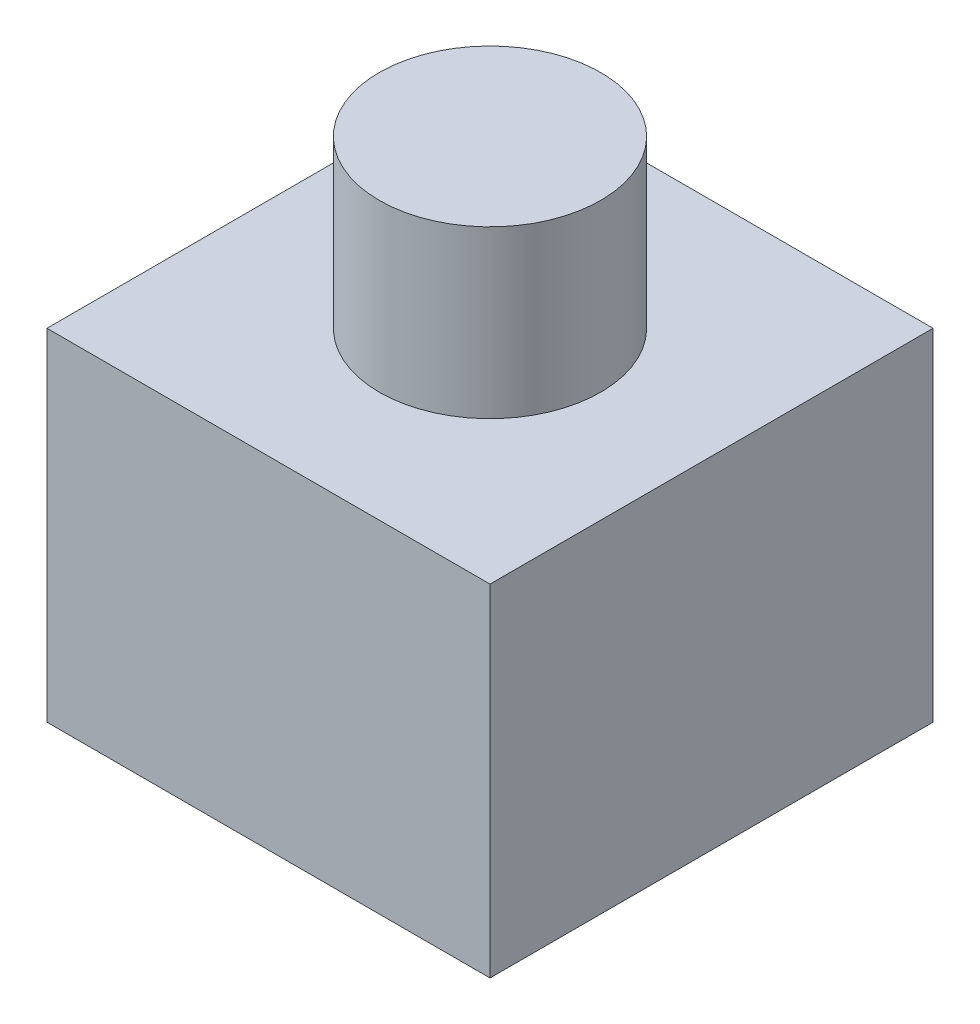
ISO-10303-21;
HEADER;
FILE_DESCRIPTION(('STEP AP214'),'2;1');
FILE_NAME('part.step','',(''),(''),'','','');
FILE_SCHEMA(('AUTOMOTIVE_DESIGN { 1 0 10303 214 1 1 1 1 }'));
ENDSEC;
DATA;
#1=APPLICATION_CONTEXT('core data for automotive mechanical design processes');
#2=APPLICATION_PROTOCOL_DEFINITION('international standard','automotive_design',2000,#1);
#3=PRODUCT_CONTEXT('',#1,'mechanical');
#4=PRODUCT('Part','Part','',(#3));
#5=PRODUCT_RELATED_PRODUCT_CATEGORY('part','',(#4));
#6=PRODUCT_DEFINITION_FORMATION('','',#4);
#7=PRODUCT_DEFINITION_CONTEXT('part definition',#1,'design');
#8=PRODUCT_DEFINITION('design','',#6,#7);
#9=PRODUCT_DEFINITION_SHAPE('','',#8);
#10=(LENGTH_UNIT() NAMED_UNIT(*) SI_UNIT(.MILLI.,.METRE.));
#11=(NAMED_UNIT(*) PLANE_ANGLE_UNIT() SI_UNIT($,.RADIAN.));
#12=(NAMED_UNIT(*) SI_UNIT($,.STERADIAN.) SOLID_ANGLE_UNIT());
#13=UNCERTAINTY_MEASURE_WITH_UNIT(LENGTH_MEASURE(1.E-05),#10,'distance_accuracy_value','');
#14=(GEOMETRIC_REPRESENTATION_CONTEXT(3) GLOBAL_UNCERTAINTY_ASSIGNED_CONTEXT((#13)) GLOBAL_UNIT_ASSIGNED_CONTEXT((#10,
#11,#12)) REPRESENTATION_CONTEXT('',''));
#15=CARTESIAN_POINT('',(0.,0.,0.));
#16=DIRECTION('',(0.,0.,1.));
#17=DIRECTION('',(1.,0.,0.));
#18=AXIS2_PLACEMENT_3D('',#15,#16,#17);
#19=CARTESIAN_POINT('',(0.,19.558,0.));
#20=DIRECTION('',(1.,0.,0.));
#21=DIRECTION('',(0.,0.,-1.));
#22=AXIS2_PLACEMENT_3D('',#19,#20,#21);
#23=PLANE('',#22);
#24=DIRECTION('',(0.,0.,1.));
#25=VECTOR('',#24,1.);
#26=CARTESIAN_POINT('',(0.,0.,0.));
#27=LINE('',#26,#25);
#28=CARTESIAN_POINT('',(0.,0.,-25.4));
#29=VERTEX_POINT('',#28);
#30=CARTESIAN_POINT('',(0.,0.,0.));
#31=VERTEX_POINT('',#30);
#32=EDGE_CURVE('E110',#29,#31,#27,.T.);
#33=ORIENTED_EDGE('',*,*,#32,.T.);
#34=DIRECTION('',(0.,-1.,0.));
#35=VECTOR('',#34,1.);
#36=CARTESIAN_POINT('',(0.,19.558,0.));
#37=LINE('',#36,#35);
#38=CARTESIAN_POINT('',(0.,19.558,0.));
#39=VERTEX_POINT('',#38);
#40=EDGE_CURVE('E42',#39,#31,#37,.T.);
#41=ORIENTED_EDGE('',*,*,#40,.F.);
#42=DIRECTION('',(0.,0.,1.));
#43=VECTOR('',#42,1.);
#44=CARTESIAN_POINT('',(0.,19.558,0.));
#45=LINE('',#44,#43);
#46=CARTESIAN_POINT('',(0.,19.558,-25.4));
#47=VERTEX_POINT('',#46);
#48=EDGE_CURVE('E93',#47,#39,#45,.T.);
#49=ORIENTED_EDGE('',*,*,#48,.F.);
#50=DIRECTION('',(0.,-1.,0.));
#51=VECTOR('',#50,1.);
#52=CARTESIAN_POINT('',(0.,19.558,-25.4));
#53=LINE('',#52,#51);
#54=EDGE_CURVE('E106',#47,#29,#53,.T.);
#55=ORIENTED_EDGE('',*,*,#54,.T.);
#56=EDGE_LOOP('',(#33,#41,#49,#55));
#57=FACE_BOUND('',#56,.T.);
#58=ADVANCED_FACE('F39',(#57),#23,.F.);
#59=CARTESIAN_POINT('',(0.,19.558,0.));
#60=DIRECTION('',(0.,0.,-1.));
#61=DIRECTION('',(-1.,0.,0.));
#62=AXIS2_PLACEMENT_3D('',#59,#60,#61);
#63=PLANE('',#62);
#64=DIRECTION('',(1.,0.,0.));
#65=VECTOR('',#64,1.);
#66=CARTESIAN_POINT('',(0.,0.,0.));
#67=LINE('',#66,#65);
#68=CARTESIAN_POINT('',(25.4,0.,0.));
#69=VERTEX_POINT('',#68);
#70=EDGE_CURVE('E99',#31,#69,#67,.T.);
#71=ORIENTED_EDGE('',*,*,#70,.T.);
#72=DIRECTION('',(0.,-1.,0.));
#73=VECTOR('',#72,1.);
#74=CARTESIAN_POINT('',(25.4,19.558,0.));
#75=LINE('',#74,#73);
#76=CARTESIAN_POINT('',(25.4,19.558,0.));
#77=VERTEX_POINT('',#76);
#78=EDGE_CURVE('E97',#77,#69,#75,.T.);
#79=ORIENTED_EDGE('',*,*,#78,.F.);
#80=DIRECTION('',(1.,0.,0.));
#81=VECTOR('',#80,1.);
#82=CARTESIAN_POINT('',(0.,19.558,0.));
#83=LINE('',#82,#81);
#84=EDGE_CURVE('E88',#39,#77,#83,.T.);
#85=ORIENTED_EDGE('',*,*,#84,.F.);
#86=ORIENTED_EDGE('',*,*,#40,.T.);
#87=EDGE_LOOP('',(#71,#79,#85,#86));
#88=FACE_BOUND('',#87,.T.);
#89=ADVANCED_FACE('F98',(#88),#63,.F.);
#90=CARTESIAN_POINT('',(25.4,19.558,0.));
#91=DIRECTION('',(-1.,0.,0.));
#92=DIRECTION('',(0.,0.,1.));
#93=AXIS2_PLACEMENT_3D('',#90,#91,#92);
#94=PLANE('',#93);
#95=DIRECTION('',(0.,0.,-1.));
#96=VECTOR('',#95,1.);
#97=CARTESIAN_POINT('',(25.4,0.,0.));
#98=LINE('',#97,#96);
#99=CARTESIAN_POINT('',(25.4,0.,-25.4));
#100=VERTEX_POINT('',#99);
#101=EDGE_CURVE('E74',#69,#100,#98,.T.);
#102=ORIENTED_EDGE('',*,*,#101,.T.);
#103=DIRECTION('',(0.,-1.,0.));
#104=VECTOR('',#103,1.);
#105=CARTESIAN_POINT('',(25.4,19.558,-25.4));
#106=LINE('',#105,#104);
#107=CARTESIAN_POINT('',(25.4,19.558,-25.4));
#108=VERTEX_POINT('',#107);
#109=EDGE_CURVE('E101',#108,#100,#106,.T.);
#110=ORIENTED_EDGE('',*,*,#109,.F.);
#111=DIRECTION('',(0.,0.,-1.));
#112=VECTOR('',#111,1.);
#113=CARTESIAN_POINT('',(25.4,19.558,0.));
#114=LINE('',#113,#112);
#115=EDGE_CURVE('E91',#77,#108,#114,.T.);
#116=ORIENTED_EDGE('',*,*,#115,.F.);
#117=ORIENTED_EDGE('',*,*,#78,.T.);
#118=EDGE_LOOP('',(#102,#110,#116,#117));
#119=FACE_BOUND('',#118,.T.);
#120=ADVANCED_FACE('F102',(#119),#94,.F.);
#121=CARTESIAN_POINT('',(0.,19.558,-25.4));
#122=DIRECTION('',(0.,0.,1.));
#123=DIRECTION('',(1.,0.,0.));
#124=AXIS2_PLACEMENT_3D('',#121,#122,#123);
#125=PLANE('',#124);
#126=DIRECTION('',(-1.,0.,0.));
#127=VECTOR('',#126,1.);
#128=CARTESIAN_POINT('',(0.,0.,-25.4));
#129=LINE('',#128,#127);
#130=EDGE_CURVE('E80',#100,#29,#129,.T.);
#131=ORIENTED_EDGE('',*,*,#130,.T.);
#132=ORIENTED_EDGE('',*,*,#54,.F.);
#133=DIRECTION('',(-1.,0.,0.));
#134=VECTOR('',#133,1.);
#135=CARTESIAN_POINT('',(0.,19.558,-25.4));
#136=LINE('',#135,#134);
#137=EDGE_CURVE('E57',#108,#47,#136,.T.);
#138=ORIENTED_EDGE('',*,*,#137,.F.);
#139=ORIENTED_EDGE('',*,*,#109,.T.);
#140=EDGE_LOOP('',(#131,#132,#138,#139));
#141=FACE_BOUND('',#140,.T.);
#142=ADVANCED_FACE('F124',(#141),#125,.F.);
#143=CARTESIAN_POINT('',(0.,19.558,0.));
#144=DIRECTION('',(0.,-1.,0.));
#145=DIRECTION('',(0.,0.,-1.));
#146=AXIS2_PLACEMENT_3D('',#143,#144,#145);
#147=PLANE('',#146);
#148=CARTESIAN_POINT('',(12.7,19.558,-12.7));
#149=DIRECTION('',(0.,1.,0.));
#150=DIRECTION('',(0.,0.,1.));
#151=AXIS2_PLACEMENT_3D('',#148,#149,#150);
#152=CIRCLE('',#151,6.35);
#153=CARTESIAN_POINT('',(12.7,19.558,-6.35));
#154=VERTEX_POINT('',#153);
#155=EDGE_CURVE('E11',#154,#154,#152,.T.);
#156=ORIENTED_EDGE('',*,*,#155,.F.);
#157=EDGE_LOOP('',(#156));
#158=FACE_BOUND('',#157,.T.);
#159=ORIENTED_EDGE('',*,*,#48,.T.);
#160=ORIENTED_EDGE('',*,*,#84,.T.);
#161=ORIENTED_EDGE('',*,*,#115,.T.);
#162=ORIENTED_EDGE('',*,*,#137,.T.);
#163=EDGE_LOOP('',(#159,#160,#161,#162));
#164=FACE_BOUND('',#163,.T.);
#165=ADVANCED_FACE('F89',(#158,#164),#147,.F.);
#166=CARTESIAN_POINT('',(0.,0.,0.));
#167=DIRECTION('',(0.,-1.,0.));
#168=DIRECTION('',(0.,0.,-1.));
#169=AXIS2_PLACEMENT_3D('',#166,#167,#168);
#170=PLANE('',#169);
#171=ORIENTED_EDGE('',*,*,#32,.F.);
#172=ORIENTED_EDGE('',*,*,#130,.F.);
#173=ORIENTED_EDGE('',*,*,#101,.F.);
#174=ORIENTED_EDGE('',*,*,#70,.F.);
#175=EDGE_LOOP('',(#171,#172,#173,#174));
#176=FACE_BOUND('',#175,.T.);
#177=ADVANCED_FACE('F127',(#176),#170,.T.);
#178=CARTESIAN_POINT('',(12.7,29.083,-12.7));
#179=DIRECTION('',(0.,-1.,0.));
#180=DIRECTION('',(0.,0.,-1.));
#181=AXIS2_PLACEMENT_3D('',#178,#179,#180);
#182=CYLINDRICAL_SURFACE('',#181,6.35);
#183=CARTESIAN_POINT('',(12.7,29.083,-12.7));
#184=DIRECTION('',(0.,1.,0.));
#185=DIRECTION('',(0.,0.,1.));
#186=AXIS2_PLACEMENT_3D('',#183,#184,#185);
#187=CIRCLE('',#186,6.35);
#188=CARTESIAN_POINT('',(12.7,29.083,-6.35));
#189=VERTEX_POINT('',#188);
#190=EDGE_CURVE('E114',#189,#189,#187,.T.);
#191=ORIENTED_EDGE('',*,*,#190,.F.);
#192=EDGE_LOOP('',(#191));
#193=FACE_BOUND('',#192,.T.);
#194=ORIENTED_EDGE('',*,*,#155,.T.);
#195=EDGE_LOOP('',(#194));
#196=FACE_BOUND('',#195,.T.);
#197=ADVANCED_FACE('F137',(#193,#196),#182,.T.);
#198=CARTESIAN_POINT('',(12.7,29.083,-12.7));
#199=DIRECTION('',(0.,1.,0.));
#200=DIRECTION('',(0.,0.,1.));
#201=AXIS2_PLACEMENT_3D('',#198,#199,#200);
#202=PLANE('',#201);
#203=ORIENTED_EDGE('',*,*,#190,.T.);
#204=EDGE_LOOP('',(#203));
#205=FACE_BOUND('',#204,.T.);
#206=ADVANCED_FACE('F135',(#205),#202,.T.);
#207=CLOSED_SHELL('',(#58,#89,#120,#142,#165,#177,#197,#206));
#208=MANIFOLD_SOLID_BREP('B2',#207);
#209=ADVANCED_BREP_SHAPE_REPRESENTATION('',(#18,#208),#14);
#210=SHAPE_DEFINITION_REPRESENTATION(#9,#209);
ENDSEC;
END-ISO-10303-21;
